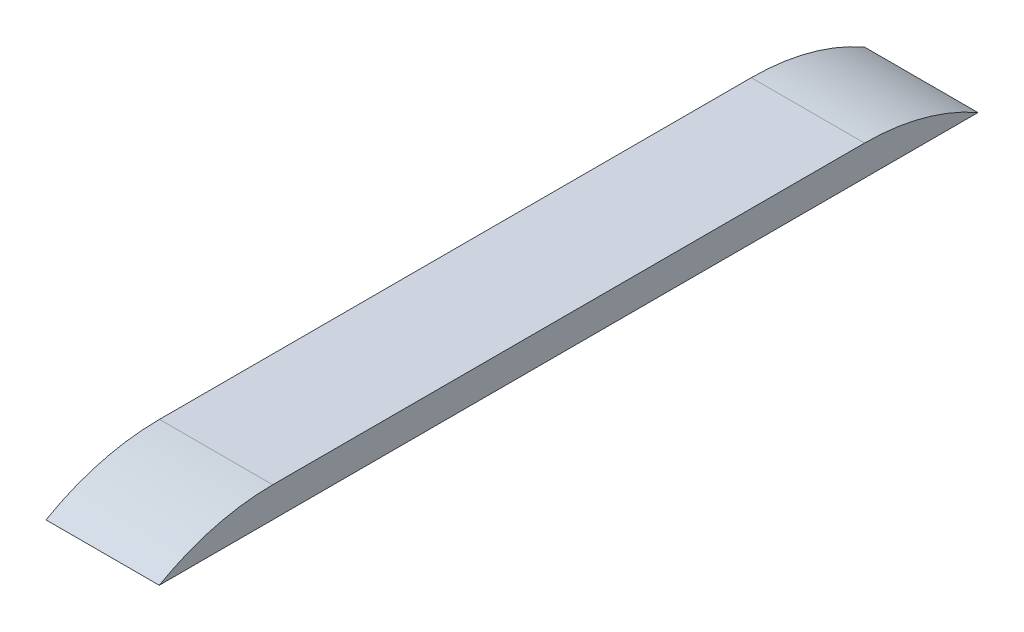
ISO-10303-21;
HEADER;
FILE_DESCRIPTION(('STEP AP214'),'2;1');
FILE_NAME('part.step','',(''),(''),'','','');
FILE_SCHEMA(('AUTOMOTIVE_DESIGN { 1 0 10303 214 1 1 1 1 }'));
ENDSEC;
DATA;
#1=APPLICATION_CONTEXT('core data for automotive mechanical design processes');
#2=APPLICATION_PROTOCOL_DEFINITION('international standard','automotive_design',2000,#1);
#3=PRODUCT_CONTEXT('',#1,'mechanical');
#4=PRODUCT('Part','Part','',(#3));
#5=PRODUCT_RELATED_PRODUCT_CATEGORY('part','',(#4));
#6=PRODUCT_DEFINITION_FORMATION('','',#4);
#7=PRODUCT_DEFINITION_CONTEXT('part definition',#1,'design');
#8=PRODUCT_DEFINITION('design','',#6,#7);
#9=PRODUCT_DEFINITION_SHAPE('','',#8);
#10=(LENGTH_UNIT() NAMED_UNIT(*) SI_UNIT(.MILLI.,.METRE.));
#11=(NAMED_UNIT(*) PLANE_ANGLE_UNIT() SI_UNIT($,.RADIAN.));
#12=(NAMED_UNIT(*) SI_UNIT($,.STERADIAN.) SOLID_ANGLE_UNIT());
#13=UNCERTAINTY_MEASURE_WITH_UNIT(LENGTH_MEASURE(1.E-05),#10,'distance_accuracy_value','');
#14=(GEOMETRIC_REPRESENTATION_CONTEXT(3) GLOBAL_UNCERTAINTY_ASSIGNED_CONTEXT((#13)) GLOBAL_UNIT_ASSIGNED_CONTEXT((#10,
#11,#12)) REPRESENTATION_CONTEXT('',''));
#15=CARTESIAN_POINT('',(0.,0.,0.));
#16=DIRECTION('',(0.,0.,1.));
#17=DIRECTION('',(1.,0.,0.));
#18=AXIS2_PLACEMENT_3D('',#15,#16,#17);
#19=CARTESIAN_POINT('',(3.73500000000001,2.,-27.));
#20=DIRECTION('',(-1.,0.,0.));
#21=DIRECTION('',(0.,0.,1.));
#22=AXIS2_PLACEMENT_3D('',#19,#20,#21);
#23=PLANE('',#22);
#24=DIRECTION('',(0.,0.,-1.));
#25=VECTOR('',#24,1.);
#26=CARTESIAN_POINT('',(3.73500000000001,0.,-27.));
#27=LINE('',#26,#25);
#28=CARTESIAN_POINT('',(3.73500000000001,0.,27.));
#29=VERTEX_POINT('',#28);
#30=CARTESIAN_POINT('',(3.73500000000001,0.,-27.));
#31=VERTEX_POINT('',#30);
#32=EDGE_CURVE('E81',#29,#31,#27,.T.);
#33=ORIENTED_EDGE('',*,*,#32,.T.);
#34=CARTESIAN_POINT('',(3.73500000000001,-13.,-19.5166852264521));
#35=DIRECTION('',(-1.,0.,0.));
#36=DIRECTION('',(0.,0.,1.));
#37=AXIS2_PLACEMENT_3D('',#34,#35,#36);
#38=CIRCLE('',#37,15.);
#39=CARTESIAN_POINT('',(3.73500000000001,2.,-19.5166852264521));
#40=VERTEX_POINT('',#39);
#41=EDGE_CURVE('E11',#31,#40,#38,.F.);
#42=ORIENTED_EDGE('',*,*,#41,.T.);
#43=DIRECTION('',(0.,0.,-1.));
#44=VECTOR('',#43,1.);
#45=CARTESIAN_POINT('',(3.73500000000001,2.,-27.));
#46=LINE('',#45,#44);
#47=CARTESIAN_POINT('',(3.73500000000001,2.,19.5166852264521));
#48=VERTEX_POINT('',#47);
#49=EDGE_CURVE('E102',#48,#40,#46,.T.);
#50=ORIENTED_EDGE('',*,*,#49,.F.);
#51=CARTESIAN_POINT('',(3.73500000000001,-13.,19.5166852264521));
#52=DIRECTION('',(-1.,0.,0.));
#53=DIRECTION('',(0.,0.,1.));
#54=AXIS2_PLACEMENT_3D('',#51,#52,#53);
#55=CIRCLE('',#54,15.);
#56=EDGE_CURVE('E85',#48,#29,#55,.F.);
#57=ORIENTED_EDGE('',*,*,#56,.T.);
#58=EDGE_LOOP('',(#33,#42,#50,#57));
#59=FACE_BOUND('',#58,.T.);
#60=ADVANCED_FACE('F37',(#59),#23,.F.);
#61=CARTESIAN_POINT('',(-3.735,2.,-27.));
#62=DIRECTION('',(1.,0.,0.));
#63=DIRECTION('',(0.,0.,-1.));
#64=AXIS2_PLACEMENT_3D('',#61,#62,#63);
#65=PLANE('',#64);
#66=DIRECTION('',(0.,0.,1.));
#67=VECTOR('',#66,1.);
#68=CARTESIAN_POINT('',(-3.735,2.,-27.));
#69=LINE('',#68,#67);
#70=CARTESIAN_POINT('',(-3.735,2.,-19.5166852264521));
#71=VERTEX_POINT('',#70);
#72=CARTESIAN_POINT('',(-3.735,2.,19.5166852264521));
#73=VERTEX_POINT('',#72);
#74=EDGE_CURVE('E99',#71,#73,#69,.T.);
#75=ORIENTED_EDGE('',*,*,#74,.F.);
#76=CARTESIAN_POINT('',(-3.735,-13.,-19.5166852264521));
#77=DIRECTION('',(1.,0.,0.));
#78=DIRECTION('',(0.,0.,-1.));
#79=AXIS2_PLACEMENT_3D('',#76,#77,#78);
#80=CIRCLE('',#79,15.);
#81=CARTESIAN_POINT('',(-3.735,0.,-27.));
#82=VERTEX_POINT('',#81);
#83=EDGE_CURVE('E45',#71,#82,#80,.F.);
#84=ORIENTED_EDGE('',*,*,#83,.T.);
#85=DIRECTION('',(0.,0.,1.));
#86=VECTOR('',#85,1.);
#87=CARTESIAN_POINT('',(-3.735,0.,-27.));
#88=LINE('',#87,#86);
#89=CARTESIAN_POINT('',(-3.735,0.,27.));
#90=VERTEX_POINT('',#89);
#91=EDGE_CURVE('E83',#82,#90,#88,.T.);
#92=ORIENTED_EDGE('',*,*,#91,.T.);
#93=CARTESIAN_POINT('',(-3.735,-13.,19.5166852264521));
#94=DIRECTION('',(1.,0.,0.));
#95=DIRECTION('',(0.,0.,-1.));
#96=AXIS2_PLACEMENT_3D('',#93,#94,#95);
#97=CIRCLE('',#96,15.);
#98=EDGE_CURVE('E90',#90,#73,#97,.F.);
#99=ORIENTED_EDGE('',*,*,#98,.T.);
#100=EDGE_LOOP('',(#75,#84,#92,#99));
#101=FACE_BOUND('',#100,.T.);
#102=ADVANCED_FACE('F111',(#101),#65,.F.);
#103=CARTESIAN_POINT('',(0.,2.,0.));
#104=DIRECTION('',(0.,1.,0.));
#105=DIRECTION('',(0.,0.,1.));
#106=AXIS2_PLACEMENT_3D('',#103,#104,#105);
#107=PLANE('',#106);
#108=ORIENTED_EDGE('',*,*,#49,.T.);
#109=DIRECTION('',(1.,0.,0.));
#110=VECTOR('',#109,1.);
#111=CARTESIAN_POINT('',(-3.735,2.,-19.5166852264521));
#112=LINE('',#111,#110);
#113=EDGE_CURVE('E87',#40,#71,#112,.F.);
#114=ORIENTED_EDGE('',*,*,#113,.T.);
#115=ORIENTED_EDGE('',*,*,#74,.T.);
#116=DIRECTION('',(-1.,0.,0.));
#117=VECTOR('',#116,1.);
#118=CARTESIAN_POINT('',(3.73500000000001,2.,19.5166852264521));
#119=LINE('',#118,#117);
#120=EDGE_CURVE('E96',#73,#48,#119,.F.);
#121=ORIENTED_EDGE('',*,*,#120,.T.);
#122=EDGE_LOOP('',(#108,#114,#115,#121));
#123=FACE_BOUND('',#122,.T.);
#124=ADVANCED_FACE('F105',(#123),#107,.T.);
#125=CARTESIAN_POINT('',(0.,0.,0.));
#126=DIRECTION('',(0.,1.,0.));
#127=DIRECTION('',(0.,0.,1.));
#128=AXIS2_PLACEMENT_3D('',#125,#126,#127);
#129=PLANE('',#128);
#130=ORIENTED_EDGE('',*,*,#32,.F.);
#131=DIRECTION('',(1.,0.,0.));
#132=VECTOR('',#131,1.);
#133=CARTESIAN_POINT('',(-3.735,0.,27.));
#134=LINE('',#133,#132);
#135=EDGE_CURVE('E100',#90,#29,#134,.T.);
#136=ORIENTED_EDGE('',*,*,#135,.F.);
#137=ORIENTED_EDGE('',*,*,#91,.F.);
#138=DIRECTION('',(-1.,0.,0.));
#139=VECTOR('',#138,1.);
#140=CARTESIAN_POINT('',(-3.735,0.,-27.));
#141=LINE('',#140,#139);
#142=EDGE_CURVE('E78',#31,#82,#141,.T.);
#143=ORIENTED_EDGE('',*,*,#142,.F.);
#144=EDGE_LOOP('',(#130,#136,#137,#143));
#145=FACE_BOUND('',#144,.T.);
#146=ADVANCED_FACE('F79',(#145),#129,.F.);
#147=CARTESIAN_POINT('',(-3.735,-13.,19.5166852264521));
#148=DIRECTION('',(1.,0.,0.));
#149=DIRECTION('',(0.,0.,-1.));
#150=AXIS2_PLACEMENT_3D('',#147,#148,#149);
#151=CYLINDRICAL_SURFACE('',#150,15.);
#152=ORIENTED_EDGE('',*,*,#98,.F.);
#153=ORIENTED_EDGE('',*,*,#135,.T.);
#154=ORIENTED_EDGE('',*,*,#56,.F.);
#155=ORIENTED_EDGE('',*,*,#120,.F.);
#156=EDGE_LOOP('',(#152,#153,#154,#155));
#157=FACE_BOUND('',#156,.T.);
#158=ADVANCED_FACE('F109',(#157),#151,.T.);
#159=CARTESIAN_POINT('',(-3.735,-13.,-19.5166852264521));
#160=DIRECTION('',(-1.,0.,0.));
#161=DIRECTION('',(0.,0.,1.));
#162=AXIS2_PLACEMENT_3D('',#159,#160,#161);
#163=CYLINDRICAL_SURFACE('',#162,15.);
#164=ORIENTED_EDGE('',*,*,#41,.F.);
#165=ORIENTED_EDGE('',*,*,#142,.T.);
#166=ORIENTED_EDGE('',*,*,#83,.F.);
#167=ORIENTED_EDGE('',*,*,#113,.F.);
#168=EDGE_LOOP('',(#164,#165,#166,#167));
#169=FACE_BOUND('',#168,.T.);
#170=ADVANCED_FACE('F39',(#169),#163,.T.);
#171=CLOSED_SHELL('',(#60,#102,#124,#146,#158,#170));
#172=MANIFOLD_SOLID_BREP('B2',#171);
#173=ADVANCED_BREP_SHAPE_REPRESENTATION('',(#18,#172),#14);
#174=SHAPE_DEFINITION_REPRESENTATION(#9,#173);
ENDSEC;
END-ISO-10303-21;
